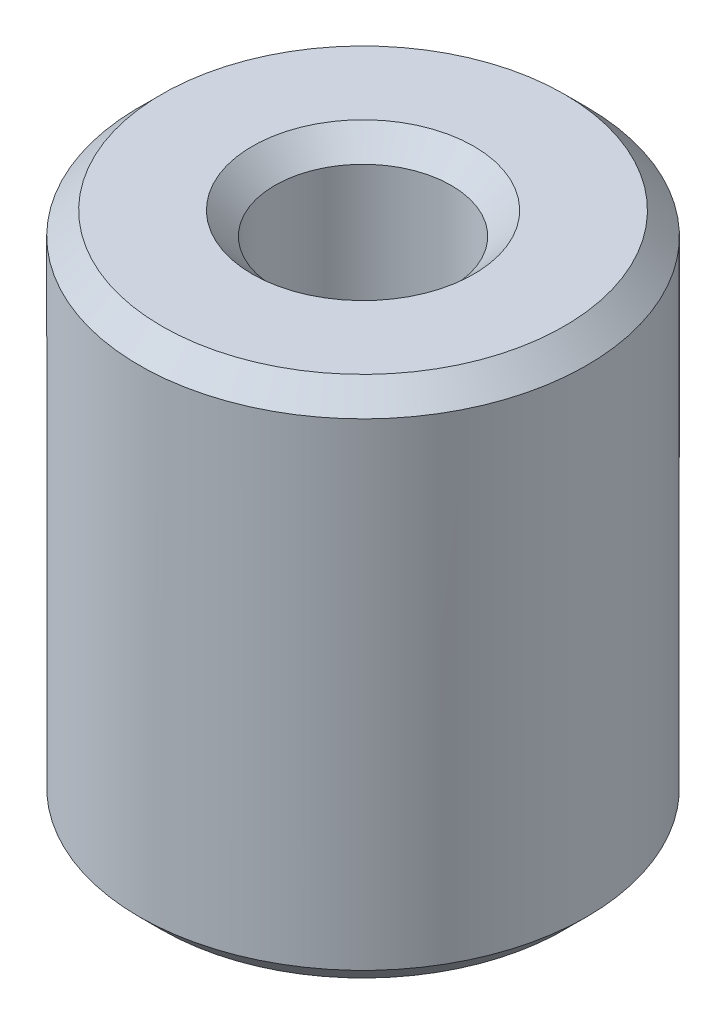
ISO-10303-21;
HEADER;
FILE_DESCRIPTION(('STEP AP214'),'2;1');
FILE_NAME('part.step','',(''),(''),'','','');
FILE_SCHEMA(('AUTOMOTIVE_DESIGN { 1 0 10303 214 1 1 1 1 }'));
ENDSEC;
DATA;
#1=APPLICATION_CONTEXT('core data for automotive mechanical design processes');
#2=APPLICATION_PROTOCOL_DEFINITION('international standard','automotive_design',2000,#1);
#3=PRODUCT_CONTEXT('',#1,'mechanical');
#4=PRODUCT('Part','Part','',(#3));
#5=PRODUCT_RELATED_PRODUCT_CATEGORY('part','',(#4));
#6=PRODUCT_DEFINITION_FORMATION('','',#4);
#7=PRODUCT_DEFINITION_CONTEXT('part definition',#1,'design');
#8=PRODUCT_DEFINITION('design','',#6,#7);
#9=PRODUCT_DEFINITION_SHAPE('','',#8);
#10=(LENGTH_UNIT() NAMED_UNIT(*) SI_UNIT(.MILLI.,.METRE.));
#11=(NAMED_UNIT(*) PLANE_ANGLE_UNIT() SI_UNIT($,.RADIAN.));
#12=(NAMED_UNIT(*) SI_UNIT($,.STERADIAN.) SOLID_ANGLE_UNIT());
#13=UNCERTAINTY_MEASURE_WITH_UNIT(LENGTH_MEASURE(1.E-05),#10,'distance_accuracy_value','');
#14=(GEOMETRIC_REPRESENTATION_CONTEXT(3) GLOBAL_UNCERTAINTY_ASSIGNED_CONTEXT((#13)) GLOBAL_UNIT_ASSIGNED_CONTEXT((#10,
#11,#12)) REPRESENTATION_CONTEXT('',''));
#15=CARTESIAN_POINT('',(0.,0.,0.));
#16=DIRECTION('',(0.,0.,1.));
#17=DIRECTION('',(1.,0.,0.));
#18=AXIS2_PLACEMENT_3D('',#15,#16,#17);
#19=CARTESIAN_POINT('',(0.,87.6344571705909,0.));
#20=DIRECTION('',(0.,-1.,0.));
#21=DIRECTION('',(0.,0.,-1.));
#22=AXIS2_PLACEMENT_3D('',#19,#20,#21);
#23=CYLINDRICAL_SURFACE('',#22,37.5);
#24=CARTESIAN_POINT('',(0.,3.78510864365149,0.));
#25=DIRECTION('',(0.,1.,0.));
#26=DIRECTION('',(0.,0.,1.));
#27=AXIS2_PLACEMENT_3D('',#24,#25,#26);
#28=CIRCLE('',#27,37.5);
#29=CARTESIAN_POINT('',(0.,3.78510864365147,-37.5));
#30=VERTEX_POINT('',#29);
#31=EDGE_CURVE('E10',#30,#30,#28,.T.);
#32=CARTESIAN_POINT('',(0.,83.8493485269394,0.));
#33=DIRECTION('',(0.,1.,0.));
#34=DIRECTION('',(0.,0.,1.));
#35=AXIS2_PLACEMENT_3D('',#32,#33,#34);
#36=CIRCLE('',#35,37.5);
#37=CARTESIAN_POINT('',(0.,83.8493485269393,-37.5));
#38=VERTEX_POINT('',#37);
#39=EDGE_CURVE('E50',#38,#38,#36,.F.);
#40=CARTESIAN_POINT('',(0.,3.78510864365147,-37.5));
#41=CARTESIAN_POINT('',(0.,4.61911114243573,-37.5));
#42=CARTESIAN_POINT('',(0.,5.45311364121997,-37.5));
#43=CARTESIAN_POINT('',(0.,7.12111863878847,-37.5));
#44=CARTESIAN_POINT('',(0.,7.95512113757272,-37.5));
#45=CARTESIAN_POINT('',(0.,9.62312613514121,-37.5));
#46=CARTESIAN_POINT('',(0.,10.4571286339255,-37.5));
#47=CARTESIAN_POINT('',(0.,12.125133631494,-37.5));
#48=CARTESIAN_POINT('',(0.,12.9591361302782,-37.5));
#49=CARTESIAN_POINT('',(0.,14.6271411278467,-37.5));
#50=CARTESIAN_POINT('',(0.,15.461143626631,-37.5));
#51=CARTESIAN_POINT('',(0.,17.1291486241995,-37.5));
#52=CARTESIAN_POINT('',(0.,17.9631511229837,-37.5));
#53=CARTESIAN_POINT('',(0.,19.6311561205522,-37.5));
#54=CARTESIAN_POINT('',(0.,20.4651586193364,-37.5));
#55=CARTESIAN_POINT('',(0.,22.1331636169049,-37.5));
#56=CARTESIAN_POINT('',(0.,22.9671661156892,-37.5));
#57=CARTESIAN_POINT('',(0.,24.6351711132577,-37.5));
#58=CARTESIAN_POINT('',(0.,25.4691736120419,-37.5));
#59=CARTESIAN_POINT('',(0.,27.1371786096104,-37.5));
#60=CARTESIAN_POINT('',(0.,27.9711811083947,-37.5));
#61=CARTESIAN_POINT('',(0.,29.6391861059632,-37.5));
#62=CARTESIAN_POINT('',(0.,30.4731886047474,-37.5));
#63=CARTESIAN_POINT('',(0.,32.1411936023159,-37.5));
#64=CARTESIAN_POINT('',(0.,32.9751961011002,-37.5));
#65=CARTESIAN_POINT('',(0.,34.6432010986687,-37.5));
#66=CARTESIAN_POINT('',(0.,35.4772035974529,-37.5));
#67=CARTESIAN_POINT('',(0.,37.1452085950214,-37.5));
#68=CARTESIAN_POINT('',(0.,37.9792110938057,-37.5));
#69=CARTESIAN_POINT('',(0.,39.6472160913742,-37.5));
#70=CARTESIAN_POINT('',(0.,40.4812185901584,-37.5));
#71=CARTESIAN_POINT('',(0.,42.1492235877269,-37.5));
#72=CARTESIAN_POINT('',(0.,42.9832260865112,-37.5));
#73=CARTESIAN_POINT('',(0.,44.6512310840797,-37.5));
#74=CARTESIAN_POINT('',(0.,45.4852335828639,-37.5));
#75=CARTESIAN_POINT('',(0.,47.1532385804324,-37.5));
#76=CARTESIAN_POINT('',(0.,47.9872410792166,-37.5));
#77=CARTESIAN_POINT('',(0.,49.6552460767851,-37.5));
#78=CARTESIAN_POINT('',(0.,50.4892485755694,-37.5));
#79=CARTESIAN_POINT('',(0.,52.1572535731379,-37.5));
#80=CARTESIAN_POINT('',(0.,52.9912560719221,-37.5));
#81=CARTESIAN_POINT('',(0.,54.6592610694906,-37.5));
#82=CARTESIAN_POINT('',(0.,55.4932635682749,-37.5));
#83=CARTESIAN_POINT('',(0.,57.1612685658434,-37.5));
#84=CARTESIAN_POINT('',(0.,57.9952710646276,-37.5));
#85=CARTESIAN_POINT('',(0.,59.6632760621961,-37.5));
#86=CARTESIAN_POINT('',(0.,60.4972785609804,-37.5));
#87=CARTESIAN_POINT('',(0.,62.1652835585489,-37.5));
#88=CARTESIAN_POINT('',(0.,62.9992860573331,-37.5));
#89=CARTESIAN_POINT('',(0.,64.6672910549016,-37.5));
#90=CARTESIAN_POINT('',(0.,65.5012935536859,-37.5));
#91=CARTESIAN_POINT('',(0.,67.1692985512544,-37.5));
#92=CARTESIAN_POINT('',(0.,68.0033010500386,-37.5));
#93=CARTESIAN_POINT('',(0.,69.6713060476071,-37.5));
#94=CARTESIAN_POINT('',(0.,70.5053085463914,-37.5));
#95=CARTESIAN_POINT('',(0.,72.1733135439599,-37.5));
#96=CARTESIAN_POINT('',(0.,73.0073160427441,-37.5));
#97=CARTESIAN_POINT('',(0.,74.6753210403126,-37.5));
#98=CARTESIAN_POINT('',(0.,75.5093235390969,-37.5));
#99=CARTESIAN_POINT('',(0.,77.1773285366654,-37.5));
#100=CARTESIAN_POINT('',(0.,78.0113310354496,-37.5));
#101=CARTESIAN_POINT('',(0.,79.6793360330181,-37.5));
#102=CARTESIAN_POINT('',(0.,80.5133385318023,-37.5));
#103=CARTESIAN_POINT('',(0.,82.1813435293708,-37.5));
#104=CARTESIAN_POINT('',(0.,83.0153460281551,-37.5));
#105=CARTESIAN_POINT('',(0.,83.8493485269393,-37.5));
#106=B_SPLINE_CURVE_WITH_KNOTS('',3,(#40,#41,#42,#43,#44,#45,#46,#47,#48,#49,#50,#51,#52,#53,
#54,#55,#56,#57,#58,#59,#60,#61,#62,#63,#64,#65,#66,#67,#68,#69,#70,#71,#72,#73,#74,#75,#76,#77,
#78,#79,#80,#81,#82,#83,#84,#85,#86,#87,#88,#89,#90,#91,#92,#93,#94,#95,#96,#97,#98,#99,#100,
#101,#102,#103,#104,#105),.UNSPECIFIED.,.F.,.F.,(4,2,2,2,2,2,2,2,2,2,2,2,2,2,2,2,2,2,2,2,2,2,2,
2,2,2,2,2,2,2,2,2,4),(0.,2.50200749635275,5.00401499270549,7.50602248905824,10.008029985411,
12.5100374817637,15.0120449781165,17.5140524744692,20.016059970822,22.5180674671747,
25.0200749635275,27.5220824598802,30.024089956233,32.5260974525857,35.0281049489384,
37.5301124452912,40.0321199416439,42.5341274379967,45.0361349343494,47.5381424307022,
50.0401499270549,52.5421574234077,55.0441649197604,57.5461724161132,60.0481799124659,
62.5501874088187,65.0521949051714,67.5542024015241,70.0562098978769,72.5582173942296,
75.0602248905824,77.5622323869351,80.0642398832879),.UNSPECIFIED.);
#107=EDGE_CURVE('BSEAM39',#30,#38,#106,.T.);
#108=ORIENTED_EDGE('',*,*,#31,.T.);
#109=ORIENTED_EDGE('',*,*,#39,.T.);
#110=ORIENTED_EDGE('',*,*,#107,.T.);
#111=ORIENTED_EDGE('',*,*,#107,.F.);
#112=EDGE_LOOP('',(#108,#110,#109,#111));
#113=FACE_BOUND('',#112,.T.);
#114=ADVANCED_FACE('F39',(#113),#23,.T.);
#115=CARTESIAN_POINT('',(0.,87.6344571705909,0.));
#116=DIRECTION('',(0.,1.,0.));
#117=DIRECTION('',(0.,0.,1.));
#118=AXIS2_PLACEMENT_3D('',#115,#116,#117);
#119=PLANE('',#118);
#120=CARTESIAN_POINT('',(0.,87.6344571705909,0.));
#121=DIRECTION('',(0.,1.,0.));
#122=DIRECTION('',(0.,0.,1.));
#123=AXIS2_PLACEMENT_3D('',#120,#121,#122);
#124=CIRCLE('',#123,18.5702988078933);
#125=CARTESIAN_POINT('',(0.,87.6344571705909,18.5702988078933));
#126=VERTEX_POINT('',#125);
#127=EDGE_CURVE('E58',#126,#126,#124,.F.);
#128=ORIENTED_EDGE('',*,*,#127,.T.);
#129=EDGE_LOOP('',(#128));
#130=FACE_BOUND('',#129,.T.);
#131=CARTESIAN_POINT('',(0.,87.6344571705909,0.));
#132=DIRECTION('',(0.,1.,0.));
#133=DIRECTION('',(0.,0.,1.));
#134=AXIS2_PLACEMENT_3D('',#131,#132,#133);
#135=CIRCLE('',#134,33.7148913563485);
#136=CARTESIAN_POINT('',(0.,87.6344571705909,-33.7148913563485));
#137=VERTEX_POINT('',#136);
#138=EDGE_CURVE('E61',#137,#137,#135,.T.);
#139=ORIENTED_EDGE('',*,*,#138,.T.);
#140=EDGE_LOOP('',(#139));
#141=FACE_BOUND('',#140,.T.);
#142=ADVANCED_FACE('F88',(#130,#141),#119,.T.);
#143=CARTESIAN_POINT('',(0.,0.,0.));
#144=DIRECTION('',(0.,1.,0.));
#145=DIRECTION('',(0.,0.,1.));
#146=AXIS2_PLACEMENT_3D('',#143,#144,#145);
#147=PLANE('',#146);
#148=CARTESIAN_POINT('',(0.,0.,0.));
#149=DIRECTION('',(0.,1.,0.));
#150=DIRECTION('',(0.,0.,1.));
#151=AXIS2_PLACEMENT_3D('',#148,#149,#150);
#152=CIRCLE('',#151,18.5702988078933);
#153=CARTESIAN_POINT('',(0.,0.,-18.5702988078933));
#154=VERTEX_POINT('',#153);
#155=EDGE_CURVE('E51',#154,#154,#152,.T.);
#156=ORIENTED_EDGE('',*,*,#155,.T.);
#157=EDGE_LOOP('',(#156));
#158=FACE_BOUND('',#157,.T.);
#159=CARTESIAN_POINT('',(0.,0.,0.));
#160=DIRECTION('',(0.,1.,0.));
#161=DIRECTION('',(0.,0.,1.));
#162=AXIS2_PLACEMENT_3D('',#159,#160,#161);
#163=CIRCLE('',#162,33.7148913563485);
#164=CARTESIAN_POINT('',(0.,0.,33.7148913563485));
#165=VERTEX_POINT('',#164);
#166=EDGE_CURVE('E54',#165,#165,#163,.F.);
#167=ORIENTED_EDGE('',*,*,#166,.T.);
#168=EDGE_LOOP('',(#167));
#169=FACE_BOUND('',#168,.T.);
#170=ADVANCED_FACE('F83',(#158,#169),#147,.F.);
#171=CARTESIAN_POINT('',(0.,87.6344571705909,0.));
#172=DIRECTION('',(0.,-1.,0.));
#173=DIRECTION('',(0.,0.,-1.));
#174=AXIS2_PLACEMENT_3D('',#171,#172,#173);
#175=CYLINDRICAL_SURFACE('',#174,14.7851901642418);
#176=CARTESIAN_POINT('',(0.,83.8493485269394,0.));
#177=DIRECTION('',(0.,1.,0.));
#178=DIRECTION('',(0.,0.,1.));
#179=AXIS2_PLACEMENT_3D('',#176,#177,#178);
#180=CIRCLE('',#179,14.7851901642418);
#181=CARTESIAN_POINT('',(0.,83.8493485269394,14.7851901642418));
#182=VERTEX_POINT('',#181);
#183=EDGE_CURVE('E67',#182,#182,#180,.T.);
#184=ORIENTED_EDGE('',*,*,#183,.T.);
#185=EDGE_LOOP('',(#184));
#186=FACE_BOUND('',#185,.T.);
#187=CARTESIAN_POINT('',(0.,3.78510864365152,0.));
#188=DIRECTION('',(0.,1.,0.));
#189=DIRECTION('',(0.,0.,1.));
#190=AXIS2_PLACEMENT_3D('',#187,#188,#189);
#191=CIRCLE('',#190,14.7851901642418);
#192=CARTESIAN_POINT('',(0.,3.78510864365152,-14.7851901642418));
#193=VERTEX_POINT('',#192);
#194=EDGE_CURVE('E69',#193,#193,#191,.F.);
#195=ORIENTED_EDGE('',*,*,#194,.T.);
#196=EDGE_LOOP('',(#195));
#197=FACE_BOUND('',#196,.T.);
#198=ADVANCED_FACE('F71',(#186,#197),#175,.F.);
#199=CARTESIAN_POINT('',(0.,83.8493485269394,0.));
#200=DIRECTION('',(0.,1.,0.));
#201=DIRECTION('',(0.,0.,1.));
#202=AXIS2_PLACEMENT_3D('',#199,#200,#201);
#203=CONICAL_SURFACE('',#202,14.7851901642418,0.785398163397451);
#204=ORIENTED_EDGE('',*,*,#127,.F.);
#205=EDGE_LOOP('',(#204));
#206=FACE_BOUND('',#205,.T.);
#207=ORIENTED_EDGE('',*,*,#183,.F.);
#208=EDGE_LOOP('',(#207));
#209=FACE_BOUND('',#208,.T.);
#210=ADVANCED_FACE('F77',(#206,#209),#203,.F.);
#211=CARTESIAN_POINT('',(0.,0.,0.));
#212=DIRECTION('',(0.,-1.,0.));
#213=DIRECTION('',(0.,0.,-1.));
#214=AXIS2_PLACEMENT_3D('',#211,#212,#213);
#215=CONICAL_SURFACE('',#214,18.5702988078933,0.785398163397446);
#216=CARTESIAN_POINT('',(0.,3.78510864365152,-14.7851901642418));
#217=CARTESIAN_POINT('',(0.,3.74568042861348,-14.8246183792798));
#218=CARTESIAN_POINT('',(0.,3.70625221357544,-14.8640465943178));
#219=CARTESIAN_POINT('',(0.,3.62739578349937,-14.9429030243939));
#220=CARTESIAN_POINT('',(0.,3.58796756846133,-14.982331239432));
#221=CARTESIAN_POINT('',(0.,3.50911113838526,-15.061187669508));
#222=CARTESIAN_POINT('',(0.,3.46968292334722,-15.1006158845461));
#223=CARTESIAN_POINT('',(0.,3.39082649327115,-15.1794723146221));
#224=CARTESIAN_POINT('',(0.,3.35139827823311,-15.2189005296602));
#225=CARTESIAN_POINT('',(0.,3.27254184815704,-15.2977569597362));
#226=CARTESIAN_POINT('',(0.,3.233113633119,-15.3371851747743));
#227=CARTESIAN_POINT('',(0.,3.15425720304293,-15.4160416048504));
#228=CARTESIAN_POINT('',(0.,3.11482898800489,-15.4554698198884));
#229=CARTESIAN_POINT('',(0.,3.03597255792882,-15.5343262499645));
#230=CARTESIAN_POINT('',(0.,2.99654434289078,-15.5737544650025));
#231=CARTESIAN_POINT('',(0.,2.91768791281471,-15.6526108950786));
#232=CARTESIAN_POINT('',(0.,2.87825969777667,-15.6920391101166));
#233=CARTESIAN_POINT('',(0.,2.7994032677006,-15.7708955401927));
#234=CARTESIAN_POINT('',(0.,2.75997505266256,-15.8103237552307));
#235=CARTESIAN_POINT('',(0.,2.68111862258649,-15.8891801853068));
#236=CARTESIAN_POINT('',(0.,2.64169040754845,-15.9286084003448));
#237=CARTESIAN_POINT('',(0.,2.56283397747238,-16.0074648304209));
#238=CARTESIAN_POINT('',(0.,2.52340576243434,-16.0468930454589));
#239=CARTESIAN_POINT('',(0.,2.44454933235827,-16.125749475535));
#240=CARTESIAN_POINT('',(0.,2.40512111732023,-16.165177690573));
#241=CARTESIAN_POINT('',(0.,2.32626468724416,-16.2440341206491));
#242=CARTESIAN_POINT('',(0.,2.28683647220612,-16.2834623356872));
#243=CARTESIAN_POINT('',(0.,2.20798004213005,-16.3623187657632));
#244=CARTESIAN_POINT('',(0.,2.16855182709201,-16.4017469808013));
#245=CARTESIAN_POINT('',(0.,2.08969539701594,-16.4806034108773));
#246=CARTESIAN_POINT('',(0.,2.0502671819779,-16.5200316259154));
#247=CARTESIAN_POINT('',(0.,1.97141075190183,-16.5988880559914));
#248=CARTESIAN_POINT('',(0.,1.93198253686379,-16.6383162710295));
#249=CARTESIAN_POINT('',(0.,1.85312610678772,-16.7171727011056));
#250=CARTESIAN_POINT('',(0.,1.81369789174968,-16.7566009161436));
#251=CARTESIAN_POINT('',(0.,1.73484146167361,-16.8354573462197));
#252=CARTESIAN_POINT('',(0.,1.69541324663558,-16.8748855612577));
#253=CARTESIAN_POINT('',(0.,1.6165568165595,-16.9537419913338));
#254=CARTESIAN_POINT('',(0.,1.57712860152146,-16.9931702063718));
#255=CARTESIAN_POINT('',(0.,1.49827217144539,-17.0720266364479));
#256=CARTESIAN_POINT('',(0.,1.45884395640736,-17.1114548514859));
#257=CARTESIAN_POINT('',(0.,1.37998752633128,-17.190311281562));
#258=CARTESIAN_POINT('',(0.,1.34055931129325,-17.2297394966));
#259=CARTESIAN_POINT('',(0.,1.26170288121717,-17.3085959266761));
#260=CARTESIAN_POINT('',(0.,1.22227466617914,-17.3480241417141));
#261=CARTESIAN_POINT('',(0.,1.14341823610306,-17.4268805717902));
#262=CARTESIAN_POINT('',(0.,1.10399002106503,-17.4663087868282));
#263=CARTESIAN_POINT('',(0.,1.02513359098895,-17.5451652169043));
#264=CARTESIAN_POINT('',(0.,0.985705375950915,-17.5845934319424));
#265=CARTESIAN_POINT('',(0.,0.906848945874842,-17.6634498620184));
#266=CARTESIAN_POINT('',(0.,0.867420730836806,-17.7028780770565));
#267=CARTESIAN_POINT('',(0.,0.788564300760733,-17.7817345071325));
#268=CARTESIAN_POINT('',(0.,0.749136085722696,-17.8211627221706));
#269=CARTESIAN_POINT('',(0.,0.670279655646622,-17.9000191522466));
#270=CARTESIAN_POINT('',(0.,0.630851440608586,-17.9394473672847));
#271=CARTESIAN_POINT('',(0.,0.551995010532513,-18.0183037973608));
#272=CARTESIAN_POINT('',(0.,0.512566795494476,-18.0577320123988));
#273=CARTESIAN_POINT('',(0.,0.433710365418403,-18.1365884424749));
#274=CARTESIAN_POINT('',(0.,0.394282150380367,-18.1760166575129));
#275=CARTESIAN_POINT('',(0.,0.315425720304293,-18.254873087589));
#276=CARTESIAN_POINT('',(0.,0.275997505266256,-18.294301302627));
#277=CARTESIAN_POINT('',(0.,0.197141075190183,-18.3731577327031));
#278=CARTESIAN_POINT('',(0.,0.157712860152146,-18.4125859477411));
#279=CARTESIAN_POINT('',(0.,0.0788564300760739,-18.4914423778172));
#280=CARTESIAN_POINT('',(0.,0.0394282150380376,-18.5308705928552));
#281=CARTESIAN_POINT('',(0.,0.,-18.5702988078933));
#282=B_SPLINE_CURVE_WITH_KNOTS('',3,(#216,#217,#218,#219,#220,#221,#222,#223,#224,#225,#226,
#227,#228,#229,#230,#231,#232,#233,#234,#235,#236,#237,#238,#239,#240,#241,#242,#243,#244,#245,
#246,#247,#248,#249,#250,#251,#252,#253,#254,#255,#256,#257,#258,#259,#260,#261,#262,#263,#264,
#265,#266,#267,#268,#269,#270,#271,#272,#273,#274,#275,#276,#277,#278,#279,#280,#281),
.UNSPECIFIED.,.F.,.F.,(4,2,2,2,2,2,2,2,2,2,2,2,2,2,2,2,2,2,2,2,2,2,2,2,2,2,2,2,2,2,2,2,4),(0.,
0.167279749340862,0.334559498681725,0.501839248022586,0.669118997363449,0.83639874670431,
1.00367849604517,1.17095824538604,1.3382379947269,1.50551774406776,1.67279749340862,
1.84007724274948,2.00735699209035,2.17463674143121,2.34191649077207,2.50919624011293,
2.67647598945379,2.84375573879466,3.01103548813552,3.17831523747638,3.34559498681724,
3.51287473615811,3.68015448549897,3.84743423483983,4.01471398418069,4.18199373352155,
4.34927348286242,4.51655323220328,4.68383298154414,4.85111273088501,5.01839248022587,
5.18567222956673,5.35295197890759),.UNSPECIFIED.);
#283=EDGE_CURVE('BSEAM73',#193,#154,#282,.T.);
#284=ORIENTED_EDGE('',*,*,#194,.F.);
#285=ORIENTED_EDGE('',*,*,#155,.F.);
#286=ORIENTED_EDGE('',*,*,#283,.T.);
#287=ORIENTED_EDGE('',*,*,#283,.F.);
#288=EDGE_LOOP('',(#284,#286,#285,#287));
#289=FACE_BOUND('',#288,.T.);
#290=ADVANCED_FACE('F73',(#289),#215,.F.);
#291=CARTESIAN_POINT('',(0.,3.78510864365149,0.));
#292=DIRECTION('',(0.,1.,0.));
#293=DIRECTION('',(0.,0.,1.));
#294=AXIS2_PLACEMENT_3D('',#291,#292,#293);
#295=CONICAL_SURFACE('',#294,37.5,0.785398163397454);
#296=ORIENTED_EDGE('',*,*,#166,.F.);
#297=EDGE_LOOP('',(#296));
#298=FACE_BOUND('',#297,.T.);
#299=ORIENTED_EDGE('',*,*,#31,.F.);
#300=EDGE_LOOP('',(#299));
#301=FACE_BOUND('',#300,.T.);
#302=ADVANCED_FACE('F76',(#298,#301),#295,.T.);
#303=CARTESIAN_POINT('',(0.,87.6344571705909,0.));
#304=DIRECTION('',(0.,-1.,0.));
#305=DIRECTION('',(0.,0.,-1.));
#306=AXIS2_PLACEMENT_3D('',#303,#304,#305);
#307=CONICAL_SURFACE('',#306,33.7148913563485,0.785398163397446);
#308=CARTESIAN_POINT('',(0.,83.8493485269394,-37.5));
#309=CARTESIAN_POINT('',(0.,83.8887767419774,-37.460571784962));
#310=CARTESIAN_POINT('',(0.,83.9282049570154,-37.4211435699239));
#311=CARTESIAN_POINT('',(0.,84.0070613870915,-37.3422871398479));
#312=CARTESIAN_POINT('',(0.,84.0464896021295,-37.3028589248098));
#313=CARTESIAN_POINT('',(0.,84.1253460322056,-37.2240024947338));
#314=CARTESIAN_POINT('',(0.,84.1647742472436,-37.1845742796957));
#315=CARTESIAN_POINT('',(0.,84.2436306773197,-37.1057178496197));
#316=CARTESIAN_POINT('',(0.,84.2830588923578,-37.0662896345816));
#317=CARTESIAN_POINT('',(0.,84.3619153224338,-36.9874332045055));
#318=CARTESIAN_POINT('',(0.,84.4013435374719,-36.9480049894675));
#319=CARTESIAN_POINT('',(0.,84.4801999675479,-36.8691485593914));
#320=CARTESIAN_POINT('',(0.,84.519628182586,-36.8297203443534));
#321=CARTESIAN_POINT('',(0.,84.598484612662,-36.7508639142773));
#322=CARTESIAN_POINT('',(0.,84.6379128277001,-36.7114356992393));
#323=CARTESIAN_POINT('',(0.,84.7167692577762,-36.6325792691632));
#324=CARTESIAN_POINT('',(0.,84.7561974728142,-36.5931510541252));
#325=CARTESIAN_POINT('',(0.,84.8350539028903,-36.5142946240491));
#326=CARTESIAN_POINT('',(0.,84.8744821179283,-36.4748664090111));
#327=CARTESIAN_POINT('',(0.,84.9533385480044,-36.396009978935));
#328=CARTESIAN_POINT('',(0.,84.9927667630424,-36.356581763897));
#329=CARTESIAN_POINT('',(0.,85.0716231931185,-36.2777253338209));
#330=CARTESIAN_POINT('',(0.,85.1110514081565,-36.2382971187828));
#331=CARTESIAN_POINT('',(0.,85.1899078382326,-36.1594406887068));
#332=CARTESIAN_POINT('',(0.,85.2293360532706,-36.1200124736687));
#333=CARTESIAN_POINT('',(0.,85.3081924833467,-36.0411560435927));
#334=CARTESIAN_POINT('',(0.,85.3476206983847,-36.0017278285546));
#335=CARTESIAN_POINT('',(0.,85.4264771284608,-35.9228713984785));
#336=CARTESIAN_POINT('',(0.,85.4659053434988,-35.8834431834405));
#337=CARTESIAN_POINT('',(0.,85.5447617735749,-35.8045867533644));
#338=CARTESIAN_POINT('',(0.,85.584189988613,-35.7651585383264));
#339=CARTESIAN_POINT('',(0.,85.663046418689,-35.6863021082503));
#340=CARTESIAN_POINT('',(0.,85.7024746337271,-35.6468738932123));
#341=CARTESIAN_POINT('',(0.,85.7813310638032,-35.5680174631362));
#342=CARTESIAN_POINT('',(0.,85.8207592788412,-35.5285892480982));
#343=CARTESIAN_POINT('',(0.,85.8996157089173,-35.4497328180221));
#344=CARTESIAN_POINT('',(0.,85.9390439239553,-35.4103046029841));
#345=CARTESIAN_POINT('',(0.,86.0179003540314,-35.331448172908));
#346=CARTESIAN_POINT('',(0.,86.0573285690694,-35.29201995787));
#347=CARTESIAN_POINT('',(0.,86.1361849991455,-35.2131635277939));
#348=CARTESIAN_POINT('',(0.,86.1756132141835,-35.1737353127559));
#349=CARTESIAN_POINT('',(0.,86.2544696442596,-35.0948788826798));
#350=CARTESIAN_POINT('',(0.,86.2938978592976,-35.0554506676418));
#351=CARTESIAN_POINT('',(0.,86.3727542893737,-34.9765942375657));
#352=CARTESIAN_POINT('',(0.,86.4121825044117,-34.9371660225276));
#353=CARTESIAN_POINT('',(0.,86.4910389344878,-34.8583095924516));
#354=CARTESIAN_POINT('',(0.,86.5304671495258,-34.8188813774135));
#355=CARTESIAN_POINT('',(0.,86.6093235796019,-34.7400249473375));
#356=CARTESIAN_POINT('',(0.,86.6487517946399,-34.7005967322994));
#357=CARTESIAN_POINT('',(0.,86.727608224716,-34.6217403022234));
#358=CARTESIAN_POINT('',(0.,86.7670364397541,-34.5823120871853));
#359=CARTESIAN_POINT('',(0.,86.8458928698301,-34.5034556571092));
#360=CARTESIAN_POINT('',(0.,86.8853210848682,-34.4640274420712));
#361=CARTESIAN_POINT('',(0.,86.9641775149442,-34.3851710119951));
#362=CARTESIAN_POINT('',(0.,87.0036057299823,-34.3457427969571));
#363=CARTESIAN_POINT('',(0.,87.0824621600584,-34.266886366881));
#364=CARTESIAN_POINT('',(0.,87.1218903750964,-34.227458151843));
#365=CARTESIAN_POINT('',(0.,87.2007468051725,-34.1486017217669));
#366=CARTESIAN_POINT('',(0.,87.2401750202105,-34.1091735067289));
#367=CARTESIAN_POINT('',(0.,87.3190314502866,-34.0303170766528));
#368=CARTESIAN_POINT('',(0.,87.3584596653246,-33.9908888616148));
#369=CARTESIAN_POINT('',(0.,87.4373160954007,-33.9120324315387));
#370=CARTESIAN_POINT('',(0.,87.4767443104387,-33.8726042165007));
#371=CARTESIAN_POINT('',(0.,87.5556007405148,-33.7937477864246));
#372=CARTESIAN_POINT('',(0.,87.5950289555528,-33.7543195713865));
#373=CARTESIAN_POINT('',(0.,87.6344571705909,-33.7148913563485));
#374=B_SPLINE_CURVE_WITH_KNOTS('',3,(#308,#309,#310,#311,#312,#313,#314,#315,#316,#317,#318,
#319,#320,#321,#322,#323,#324,#325,#326,#327,#328,#329,#330,#331,#332,#333,#334,#335,#336,#337,
#338,#339,#340,#341,#342,#343,#344,#345,#346,#347,#348,#349,#350,#351,#352,#353,#354,#355,#356,
#357,#358,#359,#360,#361,#362,#363,#364,#365,#366,#367,#368,#369,#370,#371,#372,#373),
.UNSPECIFIED.,.F.,.F.,(4,2,2,2,2,2,2,2,2,2,2,2,2,2,2,2,2,2,2,2,2,2,2,2,2,2,2,2,2,2,2,2,4),(0.,
0.167279749340855,0.334559498681719,0.501839248022579,0.669118997363443,0.836398746704308,
1.00367849604517,1.17095824538603,1.3382379947269,1.50551774406776,1.67279749340863,
1.84007724274948,2.00735699209034,2.1746367414312,2.34191649077207,2.50919624011293,
2.67647598945379,2.84375573879466,3.01103548813552,3.17831523747638,3.34559498681724,
3.51287473615811,3.68015448549896,3.84743423483982,4.01471398418069,4.18199373352155,
4.34927348286242,4.51655323220328,4.68383298154414,4.85111273088501,5.01839248022587,
5.18567222956673,5.3529519789076),.UNSPECIFIED.);
#375=EDGE_CURVE('BSEAM45',#38,#137,#374,.T.);
#376=ORIENTED_EDGE('',*,*,#39,.F.);
#377=ORIENTED_EDGE('',*,*,#138,.F.);
#378=ORIENTED_EDGE('',*,*,#375,.T.);
#379=ORIENTED_EDGE('',*,*,#375,.F.);
#380=EDGE_LOOP('',(#376,#378,#377,#379));
#381=FACE_BOUND('',#380,.T.);
#382=ADVANCED_FACE('F45',(#381),#307,.T.);
#383=CLOSED_SHELL('',(#114,#142,#170,#198,#210,#290,#302,#382));
#384=MANIFOLD_SOLID_BREP('B2',#383);
#385=ADVANCED_BREP_SHAPE_REPRESENTATION('',(#18,#384),#14);
#386=SHAPE_DEFINITION_REPRESENTATION(#9,#385);
ENDSEC;
END-ISO-10303-21;
